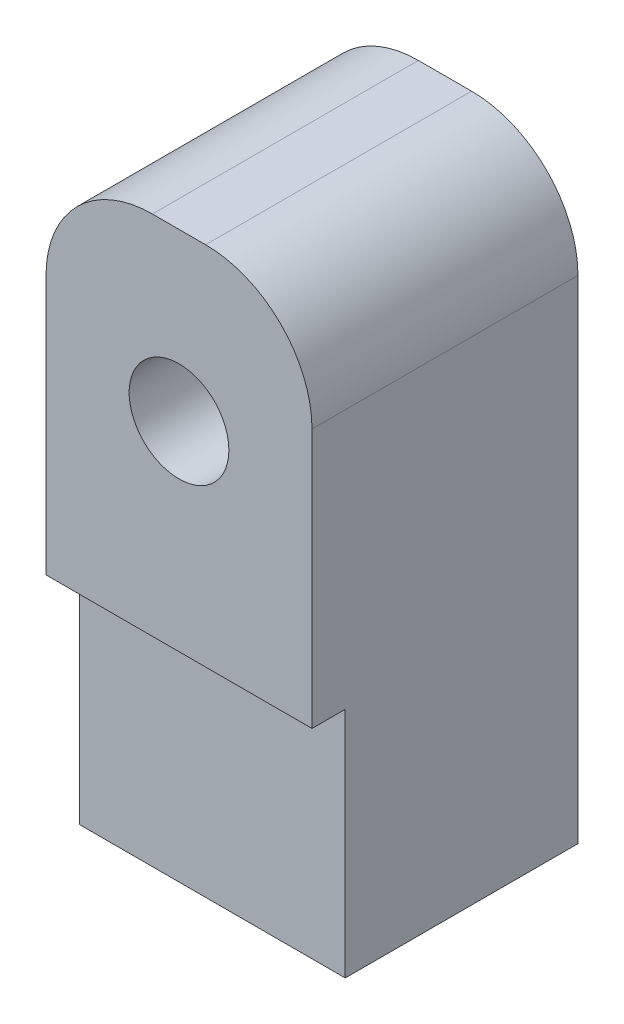
ISO-10303-21;
HEADER;
FILE_DESCRIPTION(('STEP AP214'),'2;1');
FILE_NAME('part.step','',(''),(''),'','','');
FILE_SCHEMA(('AUTOMOTIVE_DESIGN { 1 0 10303 214 1 1 1 1 }'));
ENDSEC;
DATA;
#1=APPLICATION_CONTEXT('core data for automotive mechanical design processes');
#2=APPLICATION_PROTOCOL_DEFINITION('international standard','automotive_design',2000,#1);
#3=PRODUCT_CONTEXT('',#1,'mechanical');
#4=PRODUCT('Part','Part','',(#3));
#5=PRODUCT_RELATED_PRODUCT_CATEGORY('part','',(#4));
#6=PRODUCT_DEFINITION_FORMATION('','',#4);
#7=PRODUCT_DEFINITION_CONTEXT('part definition',#1,'design');
#8=PRODUCT_DEFINITION('design','',#6,#7);
#9=PRODUCT_DEFINITION_SHAPE('','',#8);
#10=(LENGTH_UNIT() NAMED_UNIT(*) SI_UNIT(.MILLI.,.METRE.));
#11=(NAMED_UNIT(*) PLANE_ANGLE_UNIT() SI_UNIT($,.RADIAN.));
#12=(NAMED_UNIT(*) SI_UNIT($,.STERADIAN.) SOLID_ANGLE_UNIT());
#13=UNCERTAINTY_MEASURE_WITH_UNIT(LENGTH_MEASURE(1.E-05),#10,'distance_accuracy_value','');
#14=(GEOMETRIC_REPRESENTATION_CONTEXT(3) GLOBAL_UNCERTAINTY_ASSIGNED_CONTEXT((#13)) GLOBAL_UNIT_ASSIGNED_CONTEXT((#10,
#11,#12)) REPRESENTATION_CONTEXT('',''));
#15=CARTESIAN_POINT('',(0.,0.,0.));
#16=DIRECTION('',(0.,0.,1.));
#17=DIRECTION('',(1.,0.,0.));
#18=AXIS2_PLACEMENT_3D('',#15,#16,#17);
#19=CARTESIAN_POINT('',(2.54000000000001,46.99,-25.4));
#20=DIRECTION('',(0.,0.,1.));
#21=DIRECTION('',(1.,0.,0.));
#22=AXIS2_PLACEMENT_3D('',#19,#20,#21);
#23=CYLINDRICAL_SURFACE('',#22,10.16);
#24=CARTESIAN_POINT('',(2.54000000000001,46.99,0.));
#25=DIRECTION('',(0.,0.,1.));
#26=DIRECTION('',(1.,0.,0.));
#27=AXIS2_PLACEMENT_3D('',#24,#25,#26);
#28=CIRCLE('',#27,10.16);
#29=CARTESIAN_POINT('',(12.7,46.99,0.));
#30=VERTEX_POINT('',#29);
#31=CARTESIAN_POINT('',(2.54000000000001,57.15,0.));
#32=VERTEX_POINT('',#31);
#33=EDGE_CURVE('E135',#30,#32,#28,.T.);
#34=ORIENTED_EDGE('',*,*,#33,.F.);
#35=DIRECTION('',(0.,0.,1.));
#36=VECTOR('',#35,1.);
#37=CARTESIAN_POINT('',(12.7,46.99,-25.4));
#38=LINE('',#37,#36);
#39=CARTESIAN_POINT('',(12.7,46.99,-25.4));
#40=VERTEX_POINT('',#39);
#41=EDGE_CURVE('E11',#40,#30,#38,.T.);
#42=ORIENTED_EDGE('',*,*,#41,.F.);
#43=CARTESIAN_POINT('',(2.54000000000001,46.99,-25.4));
#44=DIRECTION('',(0.,0.,1.));
#45=DIRECTION('',(1.,0.,0.));
#46=AXIS2_PLACEMENT_3D('',#43,#44,#45);
#47=CIRCLE('',#46,10.16);
#48=CARTESIAN_POINT('',(2.54000000000001,57.15,-25.4));
#49=VERTEX_POINT('',#48);
#50=EDGE_CURVE('E147',#40,#49,#47,.T.);
#51=ORIENTED_EDGE('',*,*,#50,.T.);
#52=DIRECTION('',(0.,0.,1.));
#53=VECTOR('',#52,1.);
#54=CARTESIAN_POINT('',(2.54000000000001,57.15,-25.4));
#55=LINE('',#54,#53);
#56=EDGE_CURVE('E41',#49,#32,#55,.T.);
#57=ORIENTED_EDGE('',*,*,#56,.T.);
#58=EDGE_LOOP('',(#34,#42,#51,#57));
#59=FACE_BOUND('',#58,.T.);
#60=ADVANCED_FACE('F38',(#59),#23,.T.);
#61=CARTESIAN_POINT('',(12.7,0.,-25.4));
#62=DIRECTION('',(1.,0.,0.));
#63=DIRECTION('',(0.,1.,0.));
#64=AXIS2_PLACEMENT_3D('',#61,#62,#63);
#65=PLANE('',#64);
#66=DIRECTION('',(0.,1.,0.));
#67=VECTOR('',#66,1.);
#68=CARTESIAN_POINT('',(12.7,0.,-3.175));
#69=LINE('',#68,#67);
#70=CARTESIAN_POINT('',(12.7,0.,-3.175));
#71=VERTEX_POINT('',#70);
#72=CARTESIAN_POINT('',(12.7,22.225,-3.175));
#73=VERTEX_POINT('',#72);
#74=EDGE_CURVE('E185',#71,#73,#69,.T.);
#75=ORIENTED_EDGE('',*,*,#74,.F.);
#76=DIRECTION('',(0.,0.,1.));
#77=VECTOR('',#76,1.);
#78=CARTESIAN_POINT('',(12.7,0.,-25.4));
#79=LINE('',#78,#77);
#80=CARTESIAN_POINT('',(12.7,0.,-25.4));
#81=VERTEX_POINT('',#80);
#82=EDGE_CURVE('E46',#81,#71,#79,.T.);
#83=ORIENTED_EDGE('',*,*,#82,.F.);
#84=DIRECTION('',(0.,1.,0.));
#85=VECTOR('',#84,1.);
#86=CARTESIAN_POINT('',(12.7,0.,-25.4));
#87=LINE('',#86,#85);
#88=EDGE_CURVE('E124',#81,#40,#87,.T.);
#89=ORIENTED_EDGE('',*,*,#88,.T.);
#90=ORIENTED_EDGE('',*,*,#41,.T.);
#91=DIRECTION('',(0.,1.,0.));
#92=VECTOR('',#91,1.);
#93=CARTESIAN_POINT('',(12.7,0.,0.));
#94=LINE('',#93,#92);
#95=CARTESIAN_POINT('',(12.7,22.225,0.));
#96=VERTEX_POINT('',#95);
#97=EDGE_CURVE('E83',#96,#30,#94,.T.);
#98=ORIENTED_EDGE('',*,*,#97,.F.);
#99=DIRECTION('',(0.,0.,1.));
#100=VECTOR('',#99,1.);
#101=CARTESIAN_POINT('',(12.7,22.225,-3.175));
#102=LINE('',#101,#100);
#103=EDGE_CURVE('E54',#73,#96,#102,.T.);
#104=ORIENTED_EDGE('',*,*,#103,.F.);
#105=EDGE_LOOP('',(#75,#83,#89,#90,#98,#104));
#106=FACE_BOUND('',#105,.T.);
#107=ADVANCED_FACE('F214',(#106),#65,.T.);
#108=CARTESIAN_POINT('',(0.,0.,-25.4));
#109=DIRECTION('',(0.,-1.,0.));
#110=DIRECTION('',(0.,0.,-1.));
#111=AXIS2_PLACEMENT_3D('',#108,#109,#110);
#112=PLANE('',#111);
#113=CARTESIAN_POINT('',(0.,0.,-12.7));
#114=DIRECTION('',(0.,-1.,0.));
#115=DIRECTION('',(0.,0.,-1.));
#116=AXIS2_PLACEMENT_3D('',#113,#114,#115);
#117=CIRCLE('',#116,6.35);
#118=CARTESIAN_POINT('',(0.,0.,-19.05));
#119=VERTEX_POINT('',#118);
#120=EDGE_CURVE('E319',#119,#119,#117,.T.);
#121=ORIENTED_EDGE('',*,*,#120,.F.);
#122=EDGE_LOOP('',(#121));
#123=FACE_BOUND('',#122,.T.);
#124=DIRECTION('',(1.,0.,0.));
#125=VECTOR('',#124,1.);
#126=CARTESIAN_POINT('',(-12.7,0.,-3.175));
#127=LINE('',#126,#125);
#128=CARTESIAN_POINT('',(-12.7,0.,-3.175));
#129=VERTEX_POINT('',#128);
#130=EDGE_CURVE('E111',#129,#71,#127,.T.);
#131=ORIENTED_EDGE('',*,*,#130,.F.);
#132=DIRECTION('',(0.,0.,1.));
#133=VECTOR('',#132,1.);
#134=CARTESIAN_POINT('',(-12.7,0.,-25.4));
#135=LINE('',#134,#133);
#136=CARTESIAN_POINT('',(-12.7,0.,-25.4));
#137=VERTEX_POINT('',#136);
#138=EDGE_CURVE('E104',#137,#129,#135,.T.);
#139=ORIENTED_EDGE('',*,*,#138,.F.);
#140=DIRECTION('',(1.,0.,0.));
#141=VECTOR('',#140,1.);
#142=CARTESIAN_POINT('',(0.,0.,-25.4));
#143=LINE('',#142,#141);
#144=EDGE_CURVE('E108',#137,#81,#143,.T.);
#145=ORIENTED_EDGE('',*,*,#144,.T.);
#146=ORIENTED_EDGE('',*,*,#82,.T.);
#147=EDGE_LOOP('',(#131,#139,#145,#146));
#148=FACE_BOUND('',#147,.T.);
#149=ADVANCED_FACE('F106',(#123,#148),#112,.T.);
#150=CARTESIAN_POINT('',(-12.7,0.,-25.4));
#151=DIRECTION('',(-1.,0.,0.));
#152=DIRECTION('',(0.,-1.,0.));
#153=AXIS2_PLACEMENT_3D('',#150,#151,#152);
#154=PLANE('',#153);
#155=DIRECTION('',(0.,1.,0.));
#156=VECTOR('',#155,1.);
#157=CARTESIAN_POINT('',(-12.7,0.,-3.175));
#158=LINE('',#157,#156);
#159=CARTESIAN_POINT('',(-12.7,22.225,-3.175));
#160=VERTEX_POINT('',#159);
#161=EDGE_CURVE('E178',#129,#160,#158,.T.);
#162=ORIENTED_EDGE('',*,*,#161,.T.);
#163=DIRECTION('',(0.,0.,1.));
#164=VECTOR('',#163,1.);
#165=CARTESIAN_POINT('',(-12.7,22.225,-3.175));
#166=LINE('',#165,#164);
#167=CARTESIAN_POINT('',(-12.7,22.225,0.));
#168=VERTEX_POINT('',#167);
#169=EDGE_CURVE('E176',#160,#168,#166,.T.);
#170=ORIENTED_EDGE('',*,*,#169,.T.);
#171=DIRECTION('',(0.,-1.,0.));
#172=VECTOR('',#171,1.);
#173=CARTESIAN_POINT('',(-12.7,0.,0.));
#174=LINE('',#173,#172);
#175=CARTESIAN_POINT('',(-12.7,46.99,0.));
#176=VERTEX_POINT('',#175);
#177=EDGE_CURVE('E144',#176,#168,#174,.T.);
#178=ORIENTED_EDGE('',*,*,#177,.F.);
#179=DIRECTION('',(0.,0.,1.));
#180=VECTOR('',#179,1.);
#181=CARTESIAN_POINT('',(-12.7,46.99,-25.4));
#182=LINE('',#181,#180);
#183=CARTESIAN_POINT('',(-12.7,46.99,-25.4));
#184=VERTEX_POINT('',#183);
#185=EDGE_CURVE('E115',#184,#176,#182,.T.);
#186=ORIENTED_EDGE('',*,*,#185,.F.);
#187=DIRECTION('',(0.,-1.,0.));
#188=VECTOR('',#187,1.);
#189=CARTESIAN_POINT('',(-12.7,0.,-25.4));
#190=LINE('',#189,#188);
#191=EDGE_CURVE('E121',#184,#137,#190,.T.);
#192=ORIENTED_EDGE('',*,*,#191,.T.);
#193=ORIENTED_EDGE('',*,*,#138,.T.);
#194=EDGE_LOOP('',(#162,#170,#178,#186,#192,#193));
#195=FACE_BOUND('',#194,.T.);
#196=ADVANCED_FACE('F126',(#195),#154,.T.);
#197=CARTESIAN_POINT('',(-2.54,46.99,-25.4));
#198=DIRECTION('',(0.,0.,1.));
#199=DIRECTION('',(1.,0.,0.));
#200=AXIS2_PLACEMENT_3D('',#197,#198,#199);
#201=CYLINDRICAL_SURFACE('',#200,10.16);
#202=CARTESIAN_POINT('',(-2.54,46.99,0.));
#203=DIRECTION('',(0.,0.,1.));
#204=DIRECTION('',(1.,0.,0.));
#205=AXIS2_PLACEMENT_3D('',#202,#203,#204);
#206=CIRCLE('',#205,10.16);
#207=CARTESIAN_POINT('',(-2.54,57.15,0.));
#208=VERTEX_POINT('',#207);
#209=EDGE_CURVE('E141',#208,#176,#206,.T.);
#210=ORIENTED_EDGE('',*,*,#209,.F.);
#211=DIRECTION('',(0.,0.,1.));
#212=VECTOR('',#211,1.);
#213=CARTESIAN_POINT('',(-2.54,57.15,-25.4));
#214=LINE('',#213,#212);
#215=CARTESIAN_POINT('',(-2.54,57.15,-25.4));
#216=VERTEX_POINT('',#215);
#217=EDGE_CURVE('E150',#216,#208,#214,.T.);
#218=ORIENTED_EDGE('',*,*,#217,.F.);
#219=CARTESIAN_POINT('',(-2.54,46.99,-25.4));
#220=DIRECTION('',(0.,0.,1.));
#221=DIRECTION('',(1.,0.,0.));
#222=AXIS2_PLACEMENT_3D('',#219,#220,#221);
#223=CIRCLE('',#222,10.16);
#224=EDGE_CURVE('E128',#216,#184,#223,.T.);
#225=ORIENTED_EDGE('',*,*,#224,.T.);
#226=ORIENTED_EDGE('',*,*,#185,.T.);
#227=EDGE_LOOP('',(#210,#218,#225,#226));
#228=FACE_BOUND('',#227,.T.);
#229=ADVANCED_FACE('F170',(#228),#201,.T.);
#230=CARTESIAN_POINT('',(0.,57.15,-25.4));
#231=DIRECTION('',(0.,1.,0.));
#232=DIRECTION('',(0.,0.,1.));
#233=AXIS2_PLACEMENT_3D('',#230,#231,#232);
#234=PLANE('',#233);
#235=DIRECTION('',(-1.,0.,0.));
#236=VECTOR('',#235,1.);
#237=CARTESIAN_POINT('',(0.,57.15,0.));
#238=LINE('',#237,#236);
#239=EDGE_CURVE('E137',#32,#208,#238,.T.);
#240=ORIENTED_EDGE('',*,*,#239,.F.);
#241=ORIENTED_EDGE('',*,*,#56,.F.);
#242=DIRECTION('',(-1.,0.,0.));
#243=VECTOR('',#242,1.);
#244=CARTESIAN_POINT('',(0.,57.15,-25.4));
#245=LINE('',#244,#243);
#246=EDGE_CURVE('E130',#49,#216,#245,.T.);
#247=ORIENTED_EDGE('',*,*,#246,.T.);
#248=ORIENTED_EDGE('',*,*,#217,.T.);
#249=EDGE_LOOP('',(#240,#241,#247,#248));
#250=FACE_BOUND('',#249,.T.);
#251=ADVANCED_FACE('F152',(#250),#234,.T.);
#252=CARTESIAN_POINT('',(0.,0.,-25.4));
#253=DIRECTION('',(0.,0.,1.));
#254=DIRECTION('',(1.,0.,0.));
#255=AXIS2_PLACEMENT_3D('',#252,#253,#254);
#256=PLANE('',#255);
#257=CARTESIAN_POINT('',(0.,41.275,-25.4));
#258=DIRECTION('',(0.,0.,1.));
#259=DIRECTION('',(1.,0.,0.));
#260=AXIS2_PLACEMENT_3D('',#257,#258,#259);
#261=CIRCLE('',#260,6.0325);
#262=CARTESIAN_POINT('',(6.0325,41.275,-25.4));
#263=VERTEX_POINT('',#262);
#264=EDGE_CURVE('E165',#263,#263,#261,.T.);
#265=ORIENTED_EDGE('',*,*,#264,.T.);
#266=EDGE_LOOP('',(#265));
#267=FACE_BOUND('',#266,.T.);
#268=ORIENTED_EDGE('',*,*,#50,.F.);
#269=ORIENTED_EDGE('',*,*,#88,.F.);
#270=ORIENTED_EDGE('',*,*,#144,.F.);
#271=ORIENTED_EDGE('',*,*,#191,.F.);
#272=ORIENTED_EDGE('',*,*,#224,.F.);
#273=ORIENTED_EDGE('',*,*,#246,.F.);
#274=EDGE_LOOP('',(#268,#269,#270,#271,#272,#273));
#275=FACE_BOUND('',#274,.T.);
#276=ADVANCED_FACE('F119',(#267,#275),#256,.F.);
#277=CARTESIAN_POINT('',(0.,0.,0.));
#278=DIRECTION('',(0.,0.,1.));
#279=DIRECTION('',(1.,0.,0.));
#280=AXIS2_PLACEMENT_3D('',#277,#278,#279);
#281=PLANE('',#280);
#282=DIRECTION('',(1.,0.,0.));
#283=VECTOR('',#282,1.);
#284=CARTESIAN_POINT('',(-12.7,22.225,0.));
#285=LINE('',#284,#283);
#286=EDGE_CURVE('E155',#168,#96,#285,.T.);
#287=ORIENTED_EDGE('',*,*,#286,.T.);
#288=ORIENTED_EDGE('',*,*,#97,.T.);
#289=ORIENTED_EDGE('',*,*,#33,.T.);
#290=ORIENTED_EDGE('',*,*,#239,.T.);
#291=ORIENTED_EDGE('',*,*,#209,.T.);
#292=ORIENTED_EDGE('',*,*,#177,.T.);
#293=EDGE_LOOP('',(#287,#288,#289,#290,#291,#292));
#294=FACE_BOUND('',#293,.T.);
#295=CARTESIAN_POINT('',(0.,41.275,0.));
#296=DIRECTION('',(0.,0.,1.));
#297=DIRECTION('',(1.,0.,0.));
#298=AXIS2_PLACEMENT_3D('',#295,#296,#297);
#299=CIRCLE('',#298,4.7625);
#300=CARTESIAN_POINT('',(4.7625,41.275,0.));
#301=VERTEX_POINT('',#300);
#302=EDGE_CURVE('E138',#301,#301,#299,.T.);
#303=ORIENTED_EDGE('',*,*,#302,.F.);
#304=EDGE_LOOP('',(#303));
#305=FACE_BOUND('',#304,.T.);
#306=ADVANCED_FACE('F153',(#294,#305),#281,.T.);
#307=CARTESIAN_POINT('',(0.,41.275,-22.225));
#308=DIRECTION('',(0.,0.,1.));
#309=DIRECTION('',(1.,0.,0.));
#310=AXIS2_PLACEMENT_3D('',#307,#308,#309);
#311=CYLINDRICAL_SURFACE('',#310,4.7625);
#312=CARTESIAN_POINT('',(0.,41.275,-22.225));
#313=DIRECTION('',(0.,0.,1.));
#314=DIRECTION('',(1.,0.,0.));
#315=AXIS2_PLACEMENT_3D('',#312,#313,#314);
#316=CIRCLE('',#315,4.7625);
#317=CARTESIAN_POINT('',(4.7625,41.275,-22.225));
#318=VERTEX_POINT('',#317);
#319=EDGE_CURVE('E162',#318,#318,#316,.T.);
#320=ORIENTED_EDGE('',*,*,#319,.F.);
#321=EDGE_LOOP('',(#320));
#322=FACE_BOUND('',#321,.T.);
#323=ORIENTED_EDGE('',*,*,#302,.T.);
#324=EDGE_LOOP('',(#323));
#325=FACE_BOUND('',#324,.T.);
#326=ADVANCED_FACE('F157',(#322,#325),#311,.F.);
#327=CARTESIAN_POINT('',(0.,41.275,-25.4));
#328=DIRECTION('',(0.,0.,1.));
#329=DIRECTION('',(1.,0.,0.));
#330=AXIS2_PLACEMENT_3D('',#327,#328,#329);
#331=CYLINDRICAL_SURFACE('',#330,6.0325);
#332=ORIENTED_EDGE('',*,*,#264,.F.);
#333=EDGE_LOOP('',(#332));
#334=FACE_BOUND('',#333,.T.);
#335=CARTESIAN_POINT('',(0.,41.275,-22.225));
#336=DIRECTION('',(0.,0.,1.));
#337=DIRECTION('',(1.,0.,0.));
#338=AXIS2_PLACEMENT_3D('',#335,#336,#337);
#339=CIRCLE('',#338,6.0325);
#340=CARTESIAN_POINT('',(6.0325,41.275,-22.225));
#341=VERTEX_POINT('',#340);
#342=EDGE_CURVE('E191',#341,#341,#339,.T.);
#343=ORIENTED_EDGE('',*,*,#342,.T.);
#344=EDGE_LOOP('',(#343));
#345=FACE_BOUND('',#344,.T.);
#346=ADVANCED_FACE('F197',(#334,#345),#331,.F.);
#347=CARTESIAN_POINT('',(0.,41.275,-22.225));
#348=DIRECTION('',(0.,0.,1.));
#349=DIRECTION('',(1.,0.,0.));
#350=AXIS2_PLACEMENT_3D('',#347,#348,#349);
#351=PLANE('',#350);
#352=ORIENTED_EDGE('',*,*,#319,.T.);
#353=EDGE_LOOP('',(#352));
#354=FACE_BOUND('',#353,.T.);
#355=ORIENTED_EDGE('',*,*,#342,.F.);
#356=EDGE_LOOP('',(#355));
#357=FACE_BOUND('',#356,.T.);
#358=ADVANCED_FACE('F199',(#354,#357),#351,.F.);
#359=CARTESIAN_POINT('',(-12.7,0.,-3.175));
#360=DIRECTION('',(0.,0.,-1.));
#361=DIRECTION('',(0.,1.,0.));
#362=AXIS2_PLACEMENT_3D('',#359,#360,#361);
#363=PLANE('',#362);
#364=ORIENTED_EDGE('',*,*,#74,.T.);
#365=DIRECTION('',(1.,0.,0.));
#366=VECTOR('',#365,1.);
#367=CARTESIAN_POINT('',(-12.7,22.225,-3.175));
#368=LINE('',#367,#366);
#369=EDGE_CURVE('E179',#160,#73,#368,.T.);
#370=ORIENTED_EDGE('',*,*,#369,.F.);
#371=ORIENTED_EDGE('',*,*,#161,.F.);
#372=ORIENTED_EDGE('',*,*,#130,.T.);
#373=EDGE_LOOP('',(#364,#370,#371,#372));
#374=FACE_BOUND('',#373,.T.);
#375=ADVANCED_FACE('F201',(#374),#363,.F.);
#376=CARTESIAN_POINT('',(-12.7,22.225,-3.175));
#377=DIRECTION('',(0.,1.,0.));
#378=DIRECTION('',(-1.,0.,0.));
#379=AXIS2_PLACEMENT_3D('',#376,#377,#378);
#380=PLANE('',#379);
#381=ORIENTED_EDGE('',*,*,#103,.T.);
#382=ORIENTED_EDGE('',*,*,#286,.F.);
#383=ORIENTED_EDGE('',*,*,#169,.F.);
#384=ORIENTED_EDGE('',*,*,#369,.T.);
#385=EDGE_LOOP('',(#381,#382,#383,#384));
#386=FACE_BOUND('',#385,.T.);
#387=ADVANCED_FACE('F208',(#386),#380,.F.);
#388=CARTESIAN_POINT('',(0.,30.1752,-12.7));
#389=DIRECTION('',(0.,-1.,0.));
#390=DIRECTION('',(0.,0.,-1.));
#391=AXIS2_PLACEMENT_3D('',#388,#389,#390);
#392=CYLINDRICAL_SURFACE('',#391,6.35);
#393=CARTESIAN_POINT('',(0.,30.1752,-12.7));
#394=DIRECTION('',(0.,-1.,0.));
#395=DIRECTION('',(0.,0.,-1.));
#396=AXIS2_PLACEMENT_3D('',#393,#394,#395);
#397=CIRCLE('',#396,6.35);
#398=CARTESIAN_POINT('',(0.,30.1752,-19.05));
#399=VERTEX_POINT('',#398);
#400=EDGE_CURVE('E188',#399,#399,#397,.T.);
#401=ORIENTED_EDGE('',*,*,#400,.F.);
#402=EDGE_LOOP('',(#401));
#403=FACE_BOUND('',#402,.T.);
#404=ORIENTED_EDGE('',*,*,#120,.T.);
#405=EDGE_LOOP('',(#404));
#406=FACE_BOUND('',#405,.T.);
#407=ADVANCED_FACE('F289',(#403,#406),#392,.F.);
#408=CARTESIAN_POINT('',(0.,30.1752,-12.7));
#409=DIRECTION('',(0.,-1.,0.));
#410=DIRECTION('',(0.,0.,-1.));
#411=AXIS2_PLACEMENT_3D('',#408,#409,#410);
#412=PLANE('',#411);
#413=ORIENTED_EDGE('',*,*,#400,.T.);
#414=EDGE_LOOP('',(#413));
#415=FACE_BOUND('',#414,.T.);
#416=ADVANCED_FACE('F303',(#415),#412,.T.);
#417=CLOSED_SHELL('',(#60,#107,#149,#196,#229,#251,#276,#306,#326,#346,#358,#375,#387,#407,#416));
#418=MANIFOLD_SOLID_BREP('B2',#417);
#419=ADVANCED_BREP_SHAPE_REPRESENTATION('',(#18,#418),#14);
#420=SHAPE_DEFINITION_REPRESENTATION(#9,#419);
ENDSEC;
END-ISO-10303-21;
